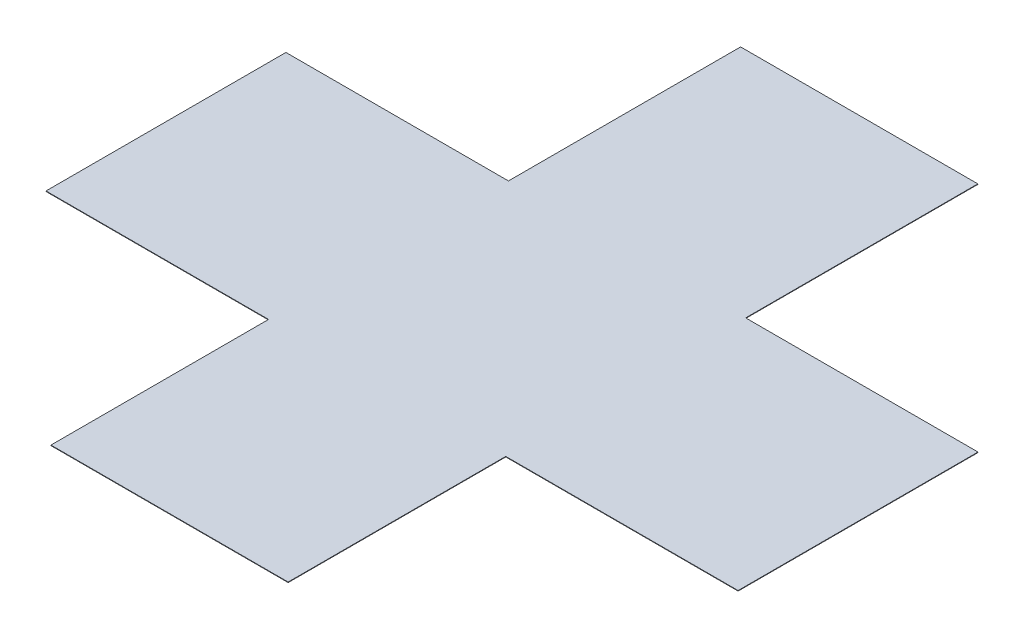
ISO-10303-21;
HEADER;
FILE_DESCRIPTION(('STEP AP214'),'2;1');
FILE_NAME('part.step','',(''),(''),'','','');
FILE_SCHEMA(('AUTOMOTIVE_DESIGN { 1 0 10303 214 1 1 1 1 }'));
ENDSEC;
DATA;
#1=APPLICATION_CONTEXT('core data for automotive mechanical design processes');
#2=APPLICATION_PROTOCOL_DEFINITION('international standard','automotive_design',2000,#1);
#3=PRODUCT_CONTEXT('',#1,'mechanical');
#4=PRODUCT('Part','Part','',(#3));
#5=PRODUCT_RELATED_PRODUCT_CATEGORY('part','',(#4));
#6=PRODUCT_DEFINITION_FORMATION('','',#4);
#7=PRODUCT_DEFINITION_CONTEXT('part definition',#1,'design');
#8=PRODUCT_DEFINITION('design','',#6,#7);
#9=PRODUCT_DEFINITION_SHAPE('','',#8);
#10=(LENGTH_UNIT() NAMED_UNIT(*) SI_UNIT(.MILLI.,.METRE.));
#11=(NAMED_UNIT(*) PLANE_ANGLE_UNIT() SI_UNIT($,.RADIAN.));
#12=(NAMED_UNIT(*) SI_UNIT($,.STERADIAN.) SOLID_ANGLE_UNIT());
#13=UNCERTAINTY_MEASURE_WITH_UNIT(LENGTH_MEASURE(1.E-05),#10,'distance_accuracy_value','');
#14=(GEOMETRIC_REPRESENTATION_CONTEXT(3) GLOBAL_UNCERTAINTY_ASSIGNED_CONTEXT((#13)) GLOBAL_UNIT_ASSIGNED_CONTEXT((#10,
#11,#12)) REPRESENTATION_CONTEXT('',''));
#15=CARTESIAN_POINT('',(0.,0.,0.));
#16=DIRECTION('',(0.,0.,1.));
#17=DIRECTION('',(1.,0.,0.));
#18=AXIS2_PLACEMENT_3D('',#15,#16,#17);
#19=CARTESIAN_POINT('',(26.67,0.00149999999999997,0.));
#20=DIRECTION('',(0.,1.,0.));
#21=DIRECTION('',(0.,0.,1.));
#22=AXIS2_PLACEMENT_3D('',#19,#20,#21);
#23=PLANE('',#22);
#24=DIRECTION('',(0.,0.,1.));
#25=VECTOR('',#24,1.);
#26=CARTESIAN_POINT('',(9.97676348985855,0.00149999999999997,0.));
#27=LINE('',#26,#25);
#28=CARTESIAN_POINT('',(9.97676348985855,0.00149999999999997,-87.151840597239));
#29=VERTEX_POINT('',#28);
#30=CARTESIAN_POINT('',(9.97676348985855,0.00149999999999997,-87.8126575445702));
#31=VERTEX_POINT('',#30);
#32=EDGE_CURVE('E138',#29,#31,#27,.F.);
#33=ORIENTED_EDGE('',*,*,#32,.F.);
#34=DIRECTION('',(1.,0.,0.));
#35=VECTOR('',#34,1.);
#36=CARTESIAN_POINT('',(26.67,0.00149999999999997,-87.151840597239));
#37=LINE('',#36,#35);
#38=CARTESIAN_POINT('',(10.6971678476306,0.00149999999999997,-87.151840597239));
#39=VERTEX_POINT('',#38);
#40=EDGE_CURVE('E130',#39,#29,#37,.F.);
#41=ORIENTED_EDGE('',*,*,#40,.F.);
#42=DIRECTION('',(0.,0.,1.));
#43=VECTOR('',#42,1.);
#44=CARTESIAN_POINT('',(10.6971678476306,0.00149999999999997,0.));
#45=LINE('',#44,#43);
#46=CARTESIAN_POINT('',(10.6971678476306,0.00149999999999997,-87.8126575445702));
#47=VERTEX_POINT('',#46);
#48=EDGE_CURVE('E124',#39,#47,#45,.F.);
#49=ORIENTED_EDGE('',*,*,#48,.T.);
#50=DIRECTION('',(1.,0.,0.));
#51=VECTOR('',#50,1.);
#52=CARTESIAN_POINT('',(26.67,0.00149999999999997,-87.8126575445702));
#53=LINE('',#52,#51);
#54=CARTESIAN_POINT('',(11.4027185073042,0.00149999999999997,-87.8126575445702));
#55=VERTEX_POINT('',#54);
#56=EDGE_CURVE('E110',#55,#47,#53,.F.);
#57=ORIENTED_EDGE('',*,*,#56,.F.);
#58=DIRECTION('',(0.,0.,1.));
#59=VECTOR('',#58,1.);
#60=CARTESIAN_POINT('',(11.4027185073042,0.00149999999999997,0.));
#61=LINE('',#60,#59);
#62=CARTESIAN_POINT('',(11.4027185073042,0.00149999999999997,-88.5411977013446));
#63=VERTEX_POINT('',#62);
#64=EDGE_CURVE('E107',#55,#63,#61,.F.);
#65=ORIENTED_EDGE('',*,*,#64,.T.);
#66=DIRECTION('',(1.,0.,0.));
#67=VECTOR('',#66,1.);
#68=CARTESIAN_POINT('',(26.67,0.00149999999999997,-88.5411977013446));
#69=LINE('',#68,#67);
#70=CARTESIAN_POINT('',(10.6971678476306,0.00149999999999997,-88.5411977013446));
#71=VERTEX_POINT('',#70);
#72=EDGE_CURVE('E178',#63,#71,#69,.F.);
#73=ORIENTED_EDGE('',*,*,#72,.T.);
#74=DIRECTION('',(0.,0.,1.));
#75=VECTOR('',#74,1.);
#76=CARTESIAN_POINT('',(10.6971678476306,0.00149999999999997,0.));
#77=LINE('',#76,#75);
#78=CARTESIAN_POINT('',(10.6971678476306,0.00149999999999997,-89.2462120291123));
#79=VERTEX_POINT('',#78);
#80=EDGE_CURVE('E174',#71,#79,#77,.F.);
#81=ORIENTED_EDGE('',*,*,#80,.T.);
#82=DIRECTION('',(1.,0.,0.));
#83=VECTOR('',#82,1.);
#84=CARTESIAN_POINT('',(26.67,0.00149999999999997,-89.2462120291123));
#85=LINE('',#84,#83);
#86=CARTESIAN_POINT('',(9.97676348985855,0.00149999999999997,-89.2462120291123));
#87=VERTEX_POINT('',#86);
#88=EDGE_CURVE('E165',#79,#87,#85,.F.);
#89=ORIENTED_EDGE('',*,*,#88,.T.);
#90=DIRECTION('',(0.,0.,1.));
#91=VECTOR('',#90,1.);
#92=CARTESIAN_POINT('',(9.97676348985855,0.00149999999999997,0.));
#93=LINE('',#92,#91);
#94=CARTESIAN_POINT('',(9.97676348985855,0.00149999999999997,-88.5411977013446));
#95=VERTEX_POINT('',#94);
#96=EDGE_CURVE('E162',#95,#87,#93,.F.);
#97=ORIENTED_EDGE('',*,*,#96,.F.);
#98=DIRECTION('',(1.,0.,0.));
#99=VECTOR('',#98,1.);
#100=CARTESIAN_POINT('',(26.67,0.00149999999999997,-88.5411977013446));
#101=LINE('',#100,#99);
#102=CARTESIAN_POINT('',(9.30092022638168,0.00149999999999997,-88.5411977013446));
#103=VERTEX_POINT('',#102);
#104=EDGE_CURVE('E152',#95,#103,#101,.F.);
#105=ORIENTED_EDGE('',*,*,#104,.T.);
#106=DIRECTION('',(0.,0.,1.));
#107=VECTOR('',#106,1.);
#108=CARTESIAN_POINT('',(9.30092022638168,0.00149999999999997,0.));
#109=LINE('',#108,#107);
#110=CARTESIAN_POINT('',(9.30092022638168,0.00149999999999997,-87.8126575445702));
#111=VERTEX_POINT('',#110);
#112=EDGE_CURVE('E150',#111,#103,#109,.F.);
#113=ORIENTED_EDGE('',*,*,#112,.F.);
#114=DIRECTION('',(1.,0.,0.));
#115=VECTOR('',#114,1.);
#116=CARTESIAN_POINT('',(26.67,0.00149999999999997,-87.8126575445702));
#117=LINE('',#116,#115);
#118=EDGE_CURVE('E144',#31,#111,#117,.F.);
#119=ORIENTED_EDGE('',*,*,#118,.F.);
#120=EDGE_LOOP('',(#33,#41,#49,#57,#65,#73,#81,#89,#97,#105,#113,#119));
#121=FACE_BOUND('',#120,.T.);
#122=ADVANCED_FACE('F16',(#121),#23,.T.);
#123=CARTESIAN_POINT('',(26.67,0.,-87.8126575445702));
#124=DIRECTION('',(0.,0.,1.));
#125=DIRECTION('',(1.,0.,0.));
#126=AXIS2_PLACEMENT_3D('',#123,#124,#125);
#127=PLANE('',#126);
#128=DIRECTION('',(1.,0.,0.));
#129=VECTOR('',#128,1.);
#130=CARTESIAN_POINT('',(26.67,0.,-87.8126575445702));
#131=LINE('',#130,#129);
#132=CARTESIAN_POINT('',(10.6971678476306,0.,-87.8126575445702));
#133=VERTEX_POINT('',#132);
#134=CARTESIAN_POINT('',(11.4027185073042,0.,-87.8126575445702));
#135=VERTEX_POINT('',#134);
#136=EDGE_CURVE('E115',#133,#135,#131,.T.);
#137=ORIENTED_EDGE('',*,*,#136,.T.);
#138=DIRECTION('',(0.,1.,0.));
#139=VECTOR('',#138,1.);
#140=CARTESIAN_POINT('',(11.4027185073042,0.,-87.8126575445702));
#141=LINE('',#140,#139);
#142=EDGE_CURVE('E19',#135,#55,#141,.T.);
#143=ORIENTED_EDGE('',*,*,#142,.T.);
#144=ORIENTED_EDGE('',*,*,#56,.T.);
#145=DIRECTION('',(0.,1.,0.));
#146=VECTOR('',#145,1.);
#147=CARTESIAN_POINT('',(10.6971678476306,0.,-87.8126575445702));
#148=LINE('',#147,#146);
#149=EDGE_CURVE('E123',#47,#133,#148,.F.);
#150=ORIENTED_EDGE('',*,*,#149,.T.);
#151=EDGE_LOOP('',(#137,#143,#144,#150));
#152=FACE_BOUND('',#151,.T.);
#153=ADVANCED_FACE('F121',(#152),#127,.T.);
#154=CARTESIAN_POINT('',(11.4027185073042,0.,0.));
#155=DIRECTION('',(-1.,0.,0.));
#156=DIRECTION('',(0.,0.,1.));
#157=AXIS2_PLACEMENT_3D('',#154,#155,#156);
#158=PLANE('',#157);
#159=ORIENTED_EDGE('',*,*,#142,.F.);
#160=DIRECTION('',(0.,0.,1.));
#161=VECTOR('',#160,1.);
#162=CARTESIAN_POINT('',(11.4027185073042,0.,0.));
#163=LINE('',#162,#161);
#164=CARTESIAN_POINT('',(11.4027185073042,0.,-88.5411977013446));
#165=VERTEX_POINT('',#164);
#166=EDGE_CURVE('E106',#135,#165,#163,.F.);
#167=ORIENTED_EDGE('',*,*,#166,.T.);
#168=DIRECTION('',(0.,1.,0.));
#169=VECTOR('',#168,1.);
#170=CARTESIAN_POINT('',(11.4027185073042,0.,-88.5411977013446));
#171=LINE('',#170,#169);
#172=EDGE_CURVE('E179',#165,#63,#171,.T.);
#173=ORIENTED_EDGE('',*,*,#172,.T.);
#174=ORIENTED_EDGE('',*,*,#64,.F.);
#175=EDGE_LOOP('',(#159,#167,#173,#174));
#176=FACE_BOUND('',#175,.T.);
#177=ADVANCED_FACE('F104',(#176),#158,.F.);
#178=CARTESIAN_POINT('',(26.67,0.,-88.5411977013446));
#179=DIRECTION('',(0.,0.,1.));
#180=DIRECTION('',(1.,0.,0.));
#181=AXIS2_PLACEMENT_3D('',#178,#179,#180);
#182=PLANE('',#181);
#183=ORIENTED_EDGE('',*,*,#172,.F.);
#184=DIRECTION('',(1.,0.,0.));
#185=VECTOR('',#184,1.);
#186=CARTESIAN_POINT('',(26.67,0.,-88.5411977013446));
#187=LINE('',#186,#185);
#188=CARTESIAN_POINT('',(10.6971678476306,0.,-88.5411977013446));
#189=VERTEX_POINT('',#188);
#190=EDGE_CURVE('E119',#165,#189,#187,.F.);
#191=ORIENTED_EDGE('',*,*,#190,.T.);
#192=DIRECTION('',(0.,1.,0.));
#193=VECTOR('',#192,1.);
#194=CARTESIAN_POINT('',(10.6971678476306,0.,-88.5411977013446));
#195=LINE('',#194,#193);
#196=EDGE_CURVE('E176',#189,#71,#195,.T.);
#197=ORIENTED_EDGE('',*,*,#196,.T.);
#198=ORIENTED_EDGE('',*,*,#72,.F.);
#199=EDGE_LOOP('',(#183,#191,#197,#198));
#200=FACE_BOUND('',#199,.T.);
#201=ADVANCED_FACE('F197',(#200),#182,.F.);
#202=CARTESIAN_POINT('',(10.6971678476306,0.,0.));
#203=DIRECTION('',(-1.,0.,0.));
#204=DIRECTION('',(0.,0.,1.));
#205=AXIS2_PLACEMENT_3D('',#202,#203,#204);
#206=PLANE('',#205);
#207=ORIENTED_EDGE('',*,*,#196,.F.);
#208=DIRECTION('',(0.,0.,1.));
#209=VECTOR('',#208,1.);
#210=CARTESIAN_POINT('',(10.6971678476306,0.,0.));
#211=LINE('',#210,#209);
#212=CARTESIAN_POINT('',(10.6971678476306,0.,-89.2462120291123));
#213=VERTEX_POINT('',#212);
#214=EDGE_CURVE('E168',#189,#213,#211,.F.);
#215=ORIENTED_EDGE('',*,*,#214,.T.);
#216=DIRECTION('',(0.,1.,0.));
#217=VECTOR('',#216,1.);
#218=CARTESIAN_POINT('',(10.6971678476306,0.,-89.2462120291123));
#219=LINE('',#218,#217);
#220=EDGE_CURVE('E171',#213,#79,#219,.T.);
#221=ORIENTED_EDGE('',*,*,#220,.T.);
#222=ORIENTED_EDGE('',*,*,#80,.F.);
#223=EDGE_LOOP('',(#207,#215,#221,#222));
#224=FACE_BOUND('',#223,.T.);
#225=ADVANCED_FACE('F204',(#224),#206,.F.);
#226=CARTESIAN_POINT('',(26.67,0.,-89.2462120291123));
#227=DIRECTION('',(0.,0.,1.));
#228=DIRECTION('',(1.,0.,0.));
#229=AXIS2_PLACEMENT_3D('',#226,#227,#228);
#230=PLANE('',#229);
#231=ORIENTED_EDGE('',*,*,#220,.F.);
#232=DIRECTION('',(1.,0.,0.));
#233=VECTOR('',#232,1.);
#234=CARTESIAN_POINT('',(26.67,0.,-89.2462120291123));
#235=LINE('',#234,#233);
#236=CARTESIAN_POINT('',(9.97676348985855,0.,-89.2462120291123));
#237=VERTEX_POINT('',#236);
#238=EDGE_CURVE('E161',#213,#237,#235,.F.);
#239=ORIENTED_EDGE('',*,*,#238,.T.);
#240=DIRECTION('',(0.,1.,0.));
#241=VECTOR('',#240,1.);
#242=CARTESIAN_POINT('',(9.97676348985855,0.,-89.2462120291123));
#243=LINE('',#242,#241);
#244=EDGE_CURVE('E164',#87,#237,#243,.F.);
#245=ORIENTED_EDGE('',*,*,#244,.F.);
#246=ORIENTED_EDGE('',*,*,#88,.F.);
#247=EDGE_LOOP('',(#231,#239,#245,#246));
#248=FACE_BOUND('',#247,.T.);
#249=ADVANCED_FACE('F207',(#248),#230,.F.);
#250=CARTESIAN_POINT('',(9.97676348985855,0.,0.));
#251=DIRECTION('',(-1.,0.,0.));
#252=DIRECTION('',(0.,0.,1.));
#253=AXIS2_PLACEMENT_3D('',#250,#251,#252);
#254=PLANE('',#253);
#255=DIRECTION('',(0.,0.,1.));
#256=VECTOR('',#255,1.);
#257=CARTESIAN_POINT('',(9.97676348985855,0.,0.));
#258=LINE('',#257,#256);
#259=CARTESIAN_POINT('',(9.97676348985855,0.,-88.5411977013446));
#260=VERTEX_POINT('',#259);
#261=EDGE_CURVE('E155',#237,#260,#258,.T.);
#262=ORIENTED_EDGE('',*,*,#261,.T.);
#263=DIRECTION('',(0.,1.,0.));
#264=VECTOR('',#263,1.);
#265=CARTESIAN_POINT('',(9.97676348985855,0.,-88.5411977013446));
#266=LINE('',#265,#264);
#267=EDGE_CURVE('E158',#260,#95,#266,.T.);
#268=ORIENTED_EDGE('',*,*,#267,.T.);
#269=ORIENTED_EDGE('',*,*,#96,.T.);
#270=ORIENTED_EDGE('',*,*,#244,.T.);
#271=EDGE_LOOP('',(#262,#268,#269,#270));
#272=FACE_BOUND('',#271,.T.);
#273=ADVANCED_FACE('F213',(#272),#254,.T.);
#274=CARTESIAN_POINT('',(26.67,0.,-88.5411977013446));
#275=DIRECTION('',(0.,0.,1.));
#276=DIRECTION('',(1.,0.,0.));
#277=AXIS2_PLACEMENT_3D('',#274,#275,#276);
#278=PLANE('',#277);
#279=ORIENTED_EDGE('',*,*,#267,.F.);
#280=DIRECTION('',(1.,0.,0.));
#281=VECTOR('',#280,1.);
#282=CARTESIAN_POINT('',(26.67,0.,-88.5411977013446));
#283=LINE('',#282,#281);
#284=CARTESIAN_POINT('',(9.30092022638168,0.,-88.5411977013446));
#285=VERTEX_POINT('',#284);
#286=EDGE_CURVE('E149',#260,#285,#283,.F.);
#287=ORIENTED_EDGE('',*,*,#286,.T.);
#288=DIRECTION('',(0.,1.,0.));
#289=VECTOR('',#288,1.);
#290=CARTESIAN_POINT('',(9.30092022638168,0.,-88.5411977013446));
#291=LINE('',#290,#289);
#292=EDGE_CURVE('E146',#103,#285,#291,.F.);
#293=ORIENTED_EDGE('',*,*,#292,.F.);
#294=ORIENTED_EDGE('',*,*,#104,.F.);
#295=EDGE_LOOP('',(#279,#287,#293,#294));
#296=FACE_BOUND('',#295,.T.);
#297=ADVANCED_FACE('F218',(#296),#278,.F.);
#298=CARTESIAN_POINT('',(9.30092022638168,0.,0.));
#299=DIRECTION('',(-1.,0.,0.));
#300=DIRECTION('',(0.,0.,1.));
#301=AXIS2_PLACEMENT_3D('',#298,#299,#300);
#302=PLANE('',#301);
#303=DIRECTION('',(0.,0.,1.));
#304=VECTOR('',#303,1.);
#305=CARTESIAN_POINT('',(9.30092022638168,0.,0.));
#306=LINE('',#305,#304);
#307=CARTESIAN_POINT('',(9.30092022638168,0.,-87.8126575445702));
#308=VERTEX_POINT('',#307);
#309=EDGE_CURVE('E143',#285,#308,#306,.T.);
#310=ORIENTED_EDGE('',*,*,#309,.T.);
#311=DIRECTION('',(0.,1.,0.));
#312=VECTOR('',#311,1.);
#313=CARTESIAN_POINT('',(9.30092022638168,0.,-87.8126575445702));
#314=LINE('',#313,#312);
#315=EDGE_CURVE('E140',#111,#308,#314,.F.);
#316=ORIENTED_EDGE('',*,*,#315,.F.);
#317=ORIENTED_EDGE('',*,*,#112,.T.);
#318=ORIENTED_EDGE('',*,*,#292,.T.);
#319=EDGE_LOOP('',(#310,#316,#317,#318));
#320=FACE_BOUND('',#319,.T.);
#321=ADVANCED_FACE('F220',(#320),#302,.T.);
#322=CARTESIAN_POINT('',(26.67,0.,-87.8126575445702));
#323=DIRECTION('',(0.,0.,1.));
#324=DIRECTION('',(1.,0.,0.));
#325=AXIS2_PLACEMENT_3D('',#322,#323,#324);
#326=PLANE('',#325);
#327=DIRECTION('',(1.,0.,0.));
#328=VECTOR('',#327,1.);
#329=CARTESIAN_POINT('',(26.67,0.,-87.8126575445702));
#330=LINE('',#329,#328);
#331=CARTESIAN_POINT('',(9.97676348985855,0.,-87.8126575445702));
#332=VERTEX_POINT('',#331);
#333=EDGE_CURVE('E137',#308,#332,#330,.T.);
#334=ORIENTED_EDGE('',*,*,#333,.T.);
#335=DIRECTION('',(0.,1.,0.));
#336=VECTOR('',#335,1.);
#337=CARTESIAN_POINT('',(9.97676348985855,0.,-87.8126575445702));
#338=LINE('',#337,#336);
#339=EDGE_CURVE('E133',#31,#332,#338,.F.);
#340=ORIENTED_EDGE('',*,*,#339,.F.);
#341=ORIENTED_EDGE('',*,*,#118,.T.);
#342=ORIENTED_EDGE('',*,*,#315,.T.);
#343=EDGE_LOOP('',(#334,#340,#341,#342));
#344=FACE_BOUND('',#343,.T.);
#345=ADVANCED_FACE('F226',(#344),#326,.T.);
#346=CARTESIAN_POINT('',(9.97676348985855,0.,0.));
#347=DIRECTION('',(-1.,0.,0.));
#348=DIRECTION('',(0.,0.,1.));
#349=AXIS2_PLACEMENT_3D('',#346,#347,#348);
#350=PLANE('',#349);
#351=DIRECTION('',(0.,0.,1.));
#352=VECTOR('',#351,1.);
#353=CARTESIAN_POINT('',(9.97676348985855,0.,0.));
#354=LINE('',#353,#352);
#355=CARTESIAN_POINT('',(9.97676348985855,0.,-87.151840597239));
#356=VERTEX_POINT('',#355);
#357=EDGE_CURVE('E134',#332,#356,#354,.T.);
#358=ORIENTED_EDGE('',*,*,#357,.T.);
#359=DIRECTION('',(0.,1.,0.));
#360=VECTOR('',#359,1.);
#361=CARTESIAN_POINT('',(9.97676348985855,0.,-87.151840597239));
#362=LINE('',#361,#360);
#363=EDGE_CURVE('E132',#29,#356,#362,.F.);
#364=ORIENTED_EDGE('',*,*,#363,.F.);
#365=ORIENTED_EDGE('',*,*,#32,.T.);
#366=ORIENTED_EDGE('',*,*,#339,.T.);
#367=EDGE_LOOP('',(#358,#364,#365,#366));
#368=FACE_BOUND('',#367,.T.);
#369=ADVANCED_FACE('F230',(#368),#350,.T.);
#370=CARTESIAN_POINT('',(26.67,0.,-87.151840597239));
#371=DIRECTION('',(0.,0.,1.));
#372=DIRECTION('',(1.,0.,0.));
#373=AXIS2_PLACEMENT_3D('',#370,#371,#372);
#374=PLANE('',#373);
#375=DIRECTION('',(1.,0.,0.));
#376=VECTOR('',#375,1.);
#377=CARTESIAN_POINT('',(26.67,0.,-87.151840597239));
#378=LINE('',#377,#376);
#379=CARTESIAN_POINT('',(10.6971678476306,0.,-87.151840597239));
#380=VERTEX_POINT('',#379);
#381=EDGE_CURVE('E25',#356,#380,#378,.T.);
#382=ORIENTED_EDGE('',*,*,#381,.T.);
#383=DIRECTION('',(0.,1.,0.));
#384=VECTOR('',#383,1.);
#385=CARTESIAN_POINT('',(10.6971678476306,0.,-87.151840597239));
#386=LINE('',#385,#384);
#387=EDGE_CURVE('E33',#380,#39,#386,.T.);
#388=ORIENTED_EDGE('',*,*,#387,.T.);
#389=ORIENTED_EDGE('',*,*,#40,.T.);
#390=ORIENTED_EDGE('',*,*,#363,.T.);
#391=EDGE_LOOP('',(#382,#388,#389,#390));
#392=FACE_BOUND('',#391,.T.);
#393=ADVANCED_FACE('F233',(#392),#374,.T.);
#394=CARTESIAN_POINT('',(10.6971678476306,0.,0.));
#395=DIRECTION('',(-1.,0.,0.));
#396=DIRECTION('',(0.,0.,1.));
#397=AXIS2_PLACEMENT_3D('',#394,#395,#396);
#398=PLANE('',#397);
#399=ORIENTED_EDGE('',*,*,#387,.F.);
#400=DIRECTION('',(0.,0.,1.));
#401=VECTOR('',#400,1.);
#402=CARTESIAN_POINT('',(10.6971678476306,0.,0.));
#403=LINE('',#402,#401);
#404=EDGE_CURVE('E11',#380,#133,#403,.F.);
#405=ORIENTED_EDGE('',*,*,#404,.T.);
#406=ORIENTED_EDGE('',*,*,#149,.F.);
#407=ORIENTED_EDGE('',*,*,#48,.F.);
#408=EDGE_LOOP('',(#399,#405,#406,#407));
#409=FACE_BOUND('',#408,.T.);
#410=ADVANCED_FACE('F234',(#409),#398,.F.);
#411=CARTESIAN_POINT('',(26.67,0.,0.));
#412=DIRECTION('',(0.,1.,0.));
#413=DIRECTION('',(0.,0.,1.));
#414=AXIS2_PLACEMENT_3D('',#411,#412,#413);
#415=PLANE('',#414);
#416=ORIENTED_EDGE('',*,*,#381,.F.);
#417=ORIENTED_EDGE('',*,*,#357,.F.);
#418=ORIENTED_EDGE('',*,*,#333,.F.);
#419=ORIENTED_EDGE('',*,*,#309,.F.);
#420=ORIENTED_EDGE('',*,*,#286,.F.);
#421=ORIENTED_EDGE('',*,*,#261,.F.);
#422=ORIENTED_EDGE('',*,*,#238,.F.);
#423=ORIENTED_EDGE('',*,*,#214,.F.);
#424=ORIENTED_EDGE('',*,*,#190,.F.);
#425=ORIENTED_EDGE('',*,*,#166,.F.);
#426=ORIENTED_EDGE('',*,*,#136,.F.);
#427=ORIENTED_EDGE('',*,*,#404,.F.);
#428=EDGE_LOOP('',(#416,#417,#418,#419,#420,#421,#422,#423,#424,#425,#426,#427));
#429=FACE_BOUND('',#428,.T.);
#430=ADVANCED_FACE('F114',(#429),#415,.F.);
#431=CLOSED_SHELL('',(#122,#153,#177,#201,#225,#249,#273,#297,#321,#345,#369,#393,#410,#430));
#432=MANIFOLD_SOLID_BREP('B1',#431);
#433=ADVANCED_BREP_SHAPE_REPRESENTATION('',(#18,#432),#14);
#434=SHAPE_DEFINITION_REPRESENTATION(#9,#433);
ENDSEC;
END-ISO-10303-21;
